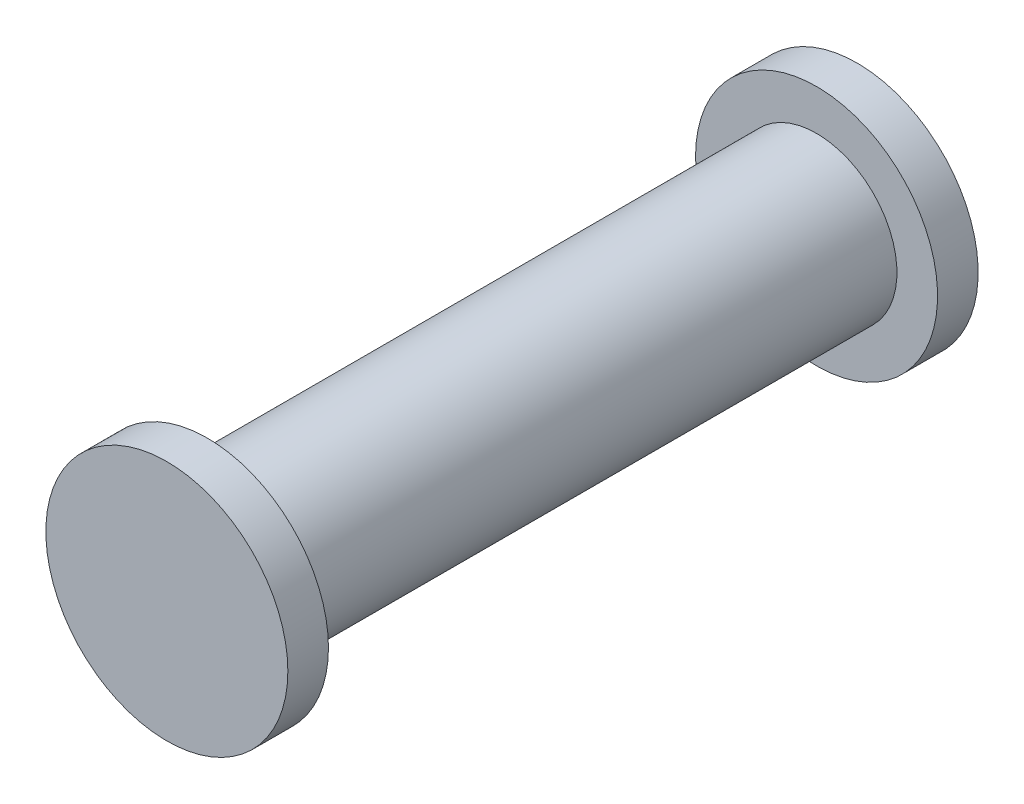
ISO-10303-21;
HEADER;
FILE_DESCRIPTION(('STEP AP214'),'2;1');
FILE_NAME('part.step','',(''),(''),'','','');
FILE_SCHEMA(('AUTOMOTIVE_DESIGN { 1 0 10303 214 1 1 1 1 }'));
ENDSEC;
DATA;
#1=APPLICATION_CONTEXT('core data for automotive mechanical design processes');
#2=APPLICATION_PROTOCOL_DEFINITION('international standard','automotive_design',2000,#1);
#3=PRODUCT_CONTEXT('',#1,'mechanical');
#4=PRODUCT('Part','Part','',(#3));
#5=PRODUCT_RELATED_PRODUCT_CATEGORY('part','',(#4));
#6=PRODUCT_DEFINITION_FORMATION('','',#4);
#7=PRODUCT_DEFINITION_CONTEXT('part definition',#1,'design');
#8=PRODUCT_DEFINITION('design','',#6,#7);
#9=PRODUCT_DEFINITION_SHAPE('','',#8);
#10=(LENGTH_UNIT() NAMED_UNIT(*) SI_UNIT(.MILLI.,.METRE.));
#11=(NAMED_UNIT(*) PLANE_ANGLE_UNIT() SI_UNIT($,.RADIAN.));
#12=(NAMED_UNIT(*) SI_UNIT($,.STERADIAN.) SOLID_ANGLE_UNIT());
#13=UNCERTAINTY_MEASURE_WITH_UNIT(LENGTH_MEASURE(1.E-05),#10,'distance_accuracy_value','');
#14=(GEOMETRIC_REPRESENTATION_CONTEXT(3) GLOBAL_UNCERTAINTY_ASSIGNED_CONTEXT((#13)) GLOBAL_UNIT_ASSIGNED_CONTEXT((#10,
#11,#12)) REPRESENTATION_CONTEXT('',''));
#15=CARTESIAN_POINT('',(0.,0.,0.));
#16=DIRECTION('',(0.,0.,1.));
#17=DIRECTION('',(1.,0.,0.));
#18=AXIS2_PLACEMENT_3D('',#15,#16,#17);
#19=CARTESIAN_POINT('',(0.,0.,37.5));
#20=DIRECTION('',(0.,0.,-1.));
#21=DIRECTION('',(-1.,0.,0.));
#22=AXIS2_PLACEMENT_3D('',#19,#20,#21);
#23=CYLINDRICAL_SURFACE('',#22,4.95);
#24=CARTESIAN_POINT('',(0.,0.,37.5));
#25=DIRECTION('',(0.,0.,1.));
#26=DIRECTION('',(1.,0.,0.));
#27=AXIS2_PLACEMENT_3D('',#24,#25,#26);
#28=CIRCLE('',#27,4.95);
#29=CARTESIAN_POINT('',(4.95,0.,37.5));
#30=VERTEX_POINT('',#29);
#31=EDGE_CURVE('E10',#30,#30,#28,.T.);
#32=ORIENTED_EDGE('',*,*,#31,.F.);
#33=EDGE_LOOP('',(#32));
#34=FACE_BOUND('',#33,.T.);
#35=CARTESIAN_POINT('',(0.,0.,0.));
#36=DIRECTION('',(0.,0.,-1.));
#37=DIRECTION('',(-1.,0.,0.));
#38=AXIS2_PLACEMENT_3D('',#35,#36,#37);
#39=CIRCLE('',#38,4.95);
#40=CARTESIAN_POINT('',(-4.95,0.,0.));
#41=VERTEX_POINT('',#40);
#42=EDGE_CURVE('E43',#41,#41,#39,.T.);
#43=ORIENTED_EDGE('',*,*,#42,.F.);
#44=EDGE_LOOP('',(#43));
#45=FACE_BOUND('',#44,.T.);
#46=ADVANCED_FACE('F36',(#34,#45),#23,.T.);
#47=CARTESIAN_POINT('',(0.,0.,-2.5));
#48=DIRECTION('',(0.,0.,1.));
#49=DIRECTION('',(1.,0.,0.));
#50=AXIS2_PLACEMENT_3D('',#47,#48,#49);
#51=CYLINDRICAL_SURFACE('',#50,7.45);
#52=CARTESIAN_POINT('',(0.,0.,-2.5));
#53=DIRECTION('',(0.,0.,-1.));
#54=DIRECTION('',(-1.,0.,0.));
#55=AXIS2_PLACEMENT_3D('',#52,#53,#54);
#56=CIRCLE('',#55,7.45);
#57=CARTESIAN_POINT('',(-7.45,0.,-2.5));
#58=VERTEX_POINT('',#57);
#59=EDGE_CURVE('E49',#58,#58,#56,.T.);
#60=ORIENTED_EDGE('',*,*,#59,.F.);
#61=EDGE_LOOP('',(#60));
#62=FACE_BOUND('',#61,.T.);
#63=CARTESIAN_POINT('',(0.,0.,0.));
#64=DIRECTION('',(0.,0.,-1.));
#65=DIRECTION('',(-1.,0.,0.));
#66=AXIS2_PLACEMENT_3D('',#63,#64,#65);
#67=CIRCLE('',#66,7.45);
#68=CARTESIAN_POINT('',(-7.45,0.,0.));
#69=VERTEX_POINT('',#68);
#70=EDGE_CURVE('E55',#69,#69,#67,.T.);
#71=ORIENTED_EDGE('',*,*,#70,.T.);
#72=EDGE_LOOP('',(#71));
#73=FACE_BOUND('',#72,.T.);
#74=ADVANCED_FACE('F88',(#62,#73),#51,.T.);
#75=CARTESIAN_POINT('',(0.,0.,-2.5));
#76=DIRECTION('',(0.,0.,-1.));
#77=DIRECTION('',(-1.,0.,0.));
#78=AXIS2_PLACEMENT_3D('',#75,#76,#77);
#79=PLANE('',#78);
#80=ORIENTED_EDGE('',*,*,#59,.T.);
#81=EDGE_LOOP('',(#80));
#82=FACE_BOUND('',#81,.T.);
#83=ADVANCED_FACE('F93',(#82),#79,.T.);
#84=CARTESIAN_POINT('',(0.,0.,0.));
#85=DIRECTION('',(0.,0.,-1.));
#86=DIRECTION('',(-1.,0.,0.));
#87=AXIS2_PLACEMENT_3D('',#84,#85,#86);
#88=PLANE('',#87);
#89=ORIENTED_EDGE('',*,*,#42,.T.);
#90=EDGE_LOOP('',(#89));
#91=FACE_BOUND('',#90,.T.);
#92=ORIENTED_EDGE('',*,*,#70,.F.);
#93=EDGE_LOOP('',(#92));
#94=FACE_BOUND('',#93,.T.);
#95=ADVANCED_FACE('F76',(#91,#94),#88,.F.);
#96=CARTESIAN_POINT('',(0.,0.,40.));
#97=DIRECTION('',(0.,0.,-1.));
#98=DIRECTION('',(-1.,0.,0.));
#99=AXIS2_PLACEMENT_3D('',#96,#97,#98);
#100=CYLINDRICAL_SURFACE('',#99,7.45);
#101=CARTESIAN_POINT('',(0.,0.,40.));
#102=DIRECTION('',(0.,0.,1.));
#103=DIRECTION('',(1.,0.,0.));
#104=AXIS2_PLACEMENT_3D('',#101,#102,#103);
#105=CIRCLE('',#104,7.45);
#106=CARTESIAN_POINT('',(7.45,0.,40.));
#107=VERTEX_POINT('',#106);
#108=EDGE_CURVE('E60',#107,#107,#105,.T.);
#109=ORIENTED_EDGE('',*,*,#108,.F.);
#110=EDGE_LOOP('',(#109));
#111=FACE_BOUND('',#110,.T.);
#112=CARTESIAN_POINT('',(0.,0.,37.5));
#113=DIRECTION('',(0.,0.,1.));
#114=DIRECTION('',(1.,0.,0.));
#115=AXIS2_PLACEMENT_3D('',#112,#113,#114);
#116=CIRCLE('',#115,7.45);
#117=CARTESIAN_POINT('',(7.45,0.,37.5));
#118=VERTEX_POINT('',#117);
#119=EDGE_CURVE('E62',#118,#118,#116,.T.);
#120=ORIENTED_EDGE('',*,*,#119,.T.);
#121=EDGE_LOOP('',(#120));
#122=FACE_BOUND('',#121,.T.);
#123=ADVANCED_FACE('F73',(#111,#122),#100,.T.);
#124=CARTESIAN_POINT('',(0.,0.,40.));
#125=DIRECTION('',(0.,0.,1.));
#126=DIRECTION('',(1.,0.,0.));
#127=AXIS2_PLACEMENT_3D('',#124,#125,#126);
#128=PLANE('',#127);
#129=ORIENTED_EDGE('',*,*,#108,.T.);
#130=EDGE_LOOP('',(#129));
#131=FACE_BOUND('',#130,.T.);
#132=ADVANCED_FACE('F71',(#131),#128,.T.);
#133=CARTESIAN_POINT('',(0.,0.,37.5));
#134=DIRECTION('',(0.,0.,1.));
#135=DIRECTION('',(1.,0.,0.));
#136=AXIS2_PLACEMENT_3D('',#133,#134,#135);
#137=PLANE('',#136);
#138=ORIENTED_EDGE('',*,*,#31,.T.);
#139=EDGE_LOOP('',(#138));
#140=FACE_BOUND('',#139,.T.);
#141=ORIENTED_EDGE('',*,*,#119,.F.);
#142=EDGE_LOOP('',(#141));
#143=FACE_BOUND('',#142,.T.);
#144=ADVANCED_FACE('F80',(#140,#143),#137,.F.);
#145=CLOSED_SHELL('',(#46,#74,#83,#95,#123,#132,#144));
#146=MANIFOLD_SOLID_BREP('B2',#145);
#147=ADVANCED_BREP_SHAPE_REPRESENTATION('',(#18,#146),#14);
#148=SHAPE_DEFINITION_REPRESENTATION(#9,#147);
ENDSEC;
END-ISO-10303-21;
